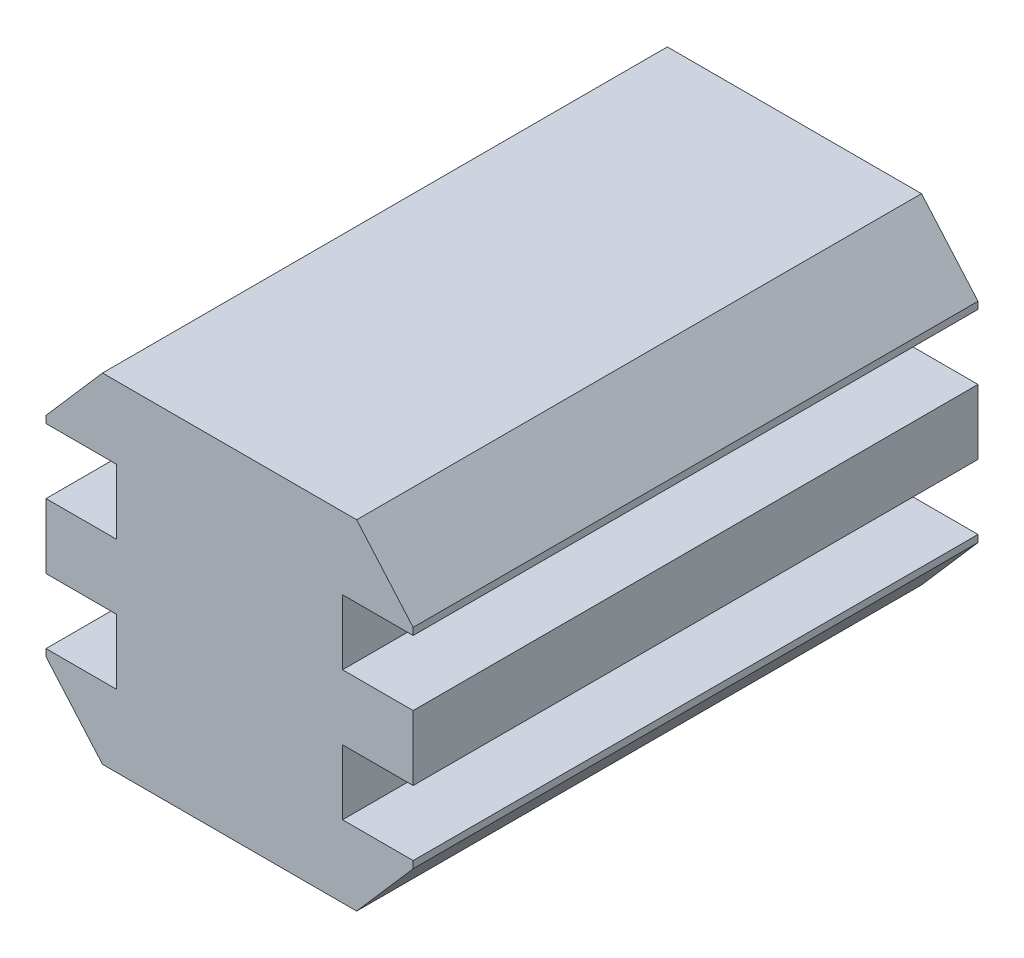
ISO-10303-21;
HEADER;
FILE_DESCRIPTION(('STEP AP214'),'2;1');
FILE_NAME('part.step','',(''),(''),'','','');
FILE_SCHEMA(('AUTOMOTIVE_DESIGN { 1 0 10303 214 1 1 1 1 }'));
ENDSEC;
DATA;
#1=APPLICATION_CONTEXT('core data for automotive mechanical design processes');
#2=APPLICATION_PROTOCOL_DEFINITION('international standard','automotive_design',2000,#1);
#3=PRODUCT_CONTEXT('',#1,'mechanical');
#4=PRODUCT('Part','Part','',(#3));
#5=PRODUCT_RELATED_PRODUCT_CATEGORY('part','',(#4));
#6=PRODUCT_DEFINITION_FORMATION('','',#4);
#7=PRODUCT_DEFINITION_CONTEXT('part definition',#1,'design');
#8=PRODUCT_DEFINITION('design','',#6,#7);
#9=PRODUCT_DEFINITION_SHAPE('','',#8);
#10=(LENGTH_UNIT() NAMED_UNIT(*) SI_UNIT(.MILLI.,.METRE.));
#11=(NAMED_UNIT(*) PLANE_ANGLE_UNIT() SI_UNIT($,.RADIAN.));
#12=(NAMED_UNIT(*) SI_UNIT($,.STERADIAN.) SOLID_ANGLE_UNIT());
#13=UNCERTAINTY_MEASURE_WITH_UNIT(LENGTH_MEASURE(1.E-05),#10,'distance_accuracy_value','');
#14=(GEOMETRIC_REPRESENTATION_CONTEXT(3) GLOBAL_UNCERTAINTY_ASSIGNED_CONTEXT((#13)) GLOBAL_UNIT_ASSIGNED_CONTEXT((#10,
#11,#12)) REPRESENTATION_CONTEXT('',''));
#15=CARTESIAN_POINT('',(0.,0.,0.));
#16=DIRECTION('',(0.,0.,1.));
#17=DIRECTION('',(1.,0.,0.));
#18=AXIS2_PLACEMENT_3D('',#15,#16,#17);
#19=CARTESIAN_POINT('',(4.,3.45,20.));
#20=DIRECTION('',(-1.,0.,0.));
#21=DIRECTION('',(0.,-1.,0.));
#22=AXIS2_PLACEMENT_3D('',#19,#20,#21);
#23=PLANE('',#22);
#24=DIRECTION('',(0.,1.,0.));
#25=VECTOR('',#24,1.);
#26=CARTESIAN_POINT('',(4.,3.45,0.));
#27=LINE('',#26,#25);
#28=CARTESIAN_POINT('',(4.,1.15,0.));
#29=VERTEX_POINT('',#28);
#30=CARTESIAN_POINT('',(4.,3.45,0.));
#31=VERTEX_POINT('',#30);
#32=EDGE_CURVE('E225',#29,#31,#27,.T.);
#33=ORIENTED_EDGE('',*,*,#32,.T.);
#34=DIRECTION('',(0.,0.,-1.));
#35=VECTOR('',#34,1.);
#36=CARTESIAN_POINT('',(4.,3.45,20.));
#37=LINE('',#36,#35);
#38=CARTESIAN_POINT('',(4.,3.45,20.));
#39=VERTEX_POINT('',#38);
#40=EDGE_CURVE('E11',#39,#31,#37,.T.);
#41=ORIENTED_EDGE('',*,*,#40,.F.);
#42=DIRECTION('',(0.,1.,0.));
#43=VECTOR('',#42,1.);
#44=CARTESIAN_POINT('',(4.,3.45,20.));
#45=LINE('',#44,#43);
#46=CARTESIAN_POINT('',(4.,1.15,20.));
#47=VERTEX_POINT('',#46);
#48=EDGE_CURVE('E271',#47,#39,#45,.T.);
#49=ORIENTED_EDGE('',*,*,#48,.F.);
#50=DIRECTION('',(0.,0.,-1.));
#51=VECTOR('',#50,1.);
#52=CARTESIAN_POINT('',(4.,1.15,20.));
#53=LINE('',#52,#51);
#54=EDGE_CURVE('E221',#47,#29,#53,.T.);
#55=ORIENTED_EDGE('',*,*,#54,.T.);
#56=EDGE_LOOP('',(#33,#41,#49,#55));
#57=FACE_BOUND('',#56,.T.);
#58=ADVANCED_FACE('F33',(#57),#23,.F.);
#59=CARTESIAN_POINT('',(6.5,3.45,20.));
#60=DIRECTION('',(0.,1.,0.));
#61=DIRECTION('',(-1.,0.,0.));
#62=AXIS2_PLACEMENT_3D('',#59,#60,#61);
#63=PLANE('',#62);
#64=DIRECTION('',(1.,0.,0.));
#65=VECTOR('',#64,1.);
#66=CARTESIAN_POINT('',(6.5,3.45,0.));
#67=LINE('',#66,#65);
#68=CARTESIAN_POINT('',(6.5,3.45,0.));
#69=VERTEX_POINT('',#68);
#70=EDGE_CURVE('E228',#31,#69,#67,.T.);
#71=ORIENTED_EDGE('',*,*,#70,.T.);
#72=DIRECTION('',(0.,0.,-1.));
#73=VECTOR('',#72,1.);
#74=CARTESIAN_POINT('',(6.5,3.45,20.));
#75=LINE('',#74,#73);
#76=CARTESIAN_POINT('',(6.5,3.45,20.));
#77=VERTEX_POINT('',#76);
#78=EDGE_CURVE('E41',#77,#69,#75,.T.);
#79=ORIENTED_EDGE('',*,*,#78,.F.);
#80=DIRECTION('',(1.,0.,0.));
#81=VECTOR('',#80,1.);
#82=CARTESIAN_POINT('',(6.5,3.45,20.));
#83=LINE('',#82,#81);
#84=EDGE_CURVE('E140',#39,#77,#83,.T.);
#85=ORIENTED_EDGE('',*,*,#84,.F.);
#86=ORIENTED_EDGE('',*,*,#40,.T.);
#87=EDGE_LOOP('',(#71,#79,#85,#86));
#88=FACE_BOUND('',#87,.T.);
#89=ADVANCED_FACE('F409',(#88),#63,.F.);
#90=CARTESIAN_POINT('',(6.5,3.7,20.));
#91=DIRECTION('',(-1.,0.,0.));
#92=DIRECTION('',(0.,-1.,0.));
#93=AXIS2_PLACEMENT_3D('',#90,#91,#92);
#94=PLANE('',#93);
#95=DIRECTION('',(0.,1.,0.));
#96=VECTOR('',#95,1.);
#97=CARTESIAN_POINT('',(6.5,3.7,0.));
#98=LINE('',#97,#96);
#99=CARTESIAN_POINT('',(6.5,3.7,0.));
#100=VERTEX_POINT('',#99);
#101=EDGE_CURVE('E230',#69,#100,#98,.T.);
#102=ORIENTED_EDGE('',*,*,#101,.T.);
#103=DIRECTION('',(0.,0.,-1.));
#104=VECTOR('',#103,1.);
#105=CARTESIAN_POINT('',(6.5,3.7,20.));
#106=LINE('',#105,#104);
#107=CARTESIAN_POINT('',(6.5,3.7,20.));
#108=VERTEX_POINT('',#107);
#109=EDGE_CURVE('E326',#108,#100,#106,.T.);
#110=ORIENTED_EDGE('',*,*,#109,.F.);
#111=DIRECTION('',(0.,1.,0.));
#112=VECTOR('',#111,1.);
#113=CARTESIAN_POINT('',(6.5,3.7,20.));
#114=LINE('',#113,#112);
#115=EDGE_CURVE('E334',#77,#108,#114,.T.);
#116=ORIENTED_EDGE('',*,*,#115,.F.);
#117=ORIENTED_EDGE('',*,*,#78,.T.);
#118=EDGE_LOOP('',(#102,#110,#116,#117));
#119=FACE_BOUND('',#118,.T.);
#120=ADVANCED_FACE('F332',(#119),#94,.F.);
#121=CARTESIAN_POINT('',(4.5,6.,20.));
#122=DIRECTION('',(-0.754605522163505,-0.656178714924786,0.));
#123=DIRECTION('',(0.656178714924786,-0.754605522163505,0.));
#124=AXIS2_PLACEMENT_3D('',#121,#122,#123);
#125=PLANE('',#124);
#126=DIRECTION('',(-0.656178714924786,0.754605522163505,0.));
#127=VECTOR('',#126,1.);
#128=CARTESIAN_POINT('',(4.5,6.,0.));
#129=LINE('',#128,#127);
#130=CARTESIAN_POINT('',(4.5,6.,0.));
#131=VERTEX_POINT('',#130);
#132=EDGE_CURVE('E232',#100,#131,#129,.T.);
#133=ORIENTED_EDGE('',*,*,#132,.T.);
#134=DIRECTION('',(0.,0.,-1.));
#135=VECTOR('',#134,1.);
#136=CARTESIAN_POINT('',(4.5,6.,20.));
#137=LINE('',#136,#135);
#138=CARTESIAN_POINT('',(4.5,6.,20.));
#139=VERTEX_POINT('',#138);
#140=EDGE_CURVE('E323',#139,#131,#137,.T.);
#141=ORIENTED_EDGE('',*,*,#140,.F.);
#142=DIRECTION('',(-0.656178714924786,0.754605522163505,0.));
#143=VECTOR('',#142,1.);
#144=CARTESIAN_POINT('',(4.5,6.,20.));
#145=LINE('',#144,#143);
#146=EDGE_CURVE('E352',#108,#139,#145,.T.);
#147=ORIENTED_EDGE('',*,*,#146,.F.);
#148=ORIENTED_EDGE('',*,*,#109,.T.);
#149=EDGE_LOOP('',(#133,#141,#147,#148));
#150=FACE_BOUND('',#149,.T.);
#151=ADVANCED_FACE('F343',(#150),#125,.F.);
#152=CARTESIAN_POINT('',(-4.5,6.,20.));
#153=DIRECTION('',(0.,-1.,0.));
#154=DIRECTION('',(1.,0.,0.));
#155=AXIS2_PLACEMENT_3D('',#152,#153,#154);
#156=PLANE('',#155);
#157=DIRECTION('',(-1.,0.,0.));
#158=VECTOR('',#157,1.);
#159=CARTESIAN_POINT('',(-4.5,6.,0.));
#160=LINE('',#159,#158);
#161=CARTESIAN_POINT('',(-4.5,6.,0.));
#162=VERTEX_POINT('',#161);
#163=EDGE_CURVE('E234',#131,#162,#160,.T.);
#164=ORIENTED_EDGE('',*,*,#163,.T.);
#165=DIRECTION('',(0.,0.,-1.));
#166=VECTOR('',#165,1.);
#167=CARTESIAN_POINT('',(-4.5,6.,20.));
#168=LINE('',#167,#166);
#169=CARTESIAN_POINT('',(-4.5,6.,20.));
#170=VERTEX_POINT('',#169);
#171=EDGE_CURVE('E320',#170,#162,#168,.T.);
#172=ORIENTED_EDGE('',*,*,#171,.F.);
#173=DIRECTION('',(-1.,0.,0.));
#174=VECTOR('',#173,1.);
#175=CARTESIAN_POINT('',(-4.5,6.,20.));
#176=LINE('',#175,#174);
#177=EDGE_CURVE('E349',#139,#170,#176,.T.);
#178=ORIENTED_EDGE('',*,*,#177,.F.);
#179=ORIENTED_EDGE('',*,*,#140,.T.);
#180=EDGE_LOOP('',(#164,#172,#178,#179));
#181=FACE_BOUND('',#180,.T.);
#182=ADVANCED_FACE('F347',(#181),#156,.F.);
#183=CARTESIAN_POINT('',(-4.5,6.,20.));
#184=DIRECTION('',(0.754605522163505,-0.656178714924786,0.));
#185=DIRECTION('',(0.656178714924786,0.754605522163505,0.));
#186=AXIS2_PLACEMENT_3D('',#183,#184,#185);
#187=PLANE('',#186);
#188=DIRECTION('',(-0.656178714924786,-0.754605522163505,0.));
#189=VECTOR('',#188,1.);
#190=CARTESIAN_POINT('',(-4.5,6.,0.));
#191=LINE('',#190,#189);
#192=CARTESIAN_POINT('',(-6.49999999999999,3.7,0.));
#193=VERTEX_POINT('',#192);
#194=EDGE_CURVE('E236',#162,#193,#191,.T.);
#195=ORIENTED_EDGE('',*,*,#194,.T.);
#196=DIRECTION('',(0.,0.,-1.));
#197=VECTOR('',#196,1.);
#198=CARTESIAN_POINT('',(-6.49999999999999,3.7,20.));
#199=LINE('',#198,#197);
#200=CARTESIAN_POINT('',(-6.49999999999999,3.7,20.));
#201=VERTEX_POINT('',#200);
#202=EDGE_CURVE('E317',#201,#193,#199,.T.);
#203=ORIENTED_EDGE('',*,*,#202,.F.);
#204=DIRECTION('',(-0.656178714924786,-0.754605522163505,0.));
#205=VECTOR('',#204,1.);
#206=CARTESIAN_POINT('',(-4.5,6.,20.));
#207=LINE('',#206,#205);
#208=EDGE_CURVE('E351',#170,#201,#207,.T.);
#209=ORIENTED_EDGE('',*,*,#208,.F.);
#210=ORIENTED_EDGE('',*,*,#171,.T.);
#211=EDGE_LOOP('',(#195,#203,#209,#210));
#212=FACE_BOUND('',#211,.T.);
#213=ADVANCED_FACE('F422',(#212),#187,.F.);
#214=CARTESIAN_POINT('',(-6.49999999999999,3.7,20.));
#215=DIRECTION('',(1.,0.,0.));
#216=DIRECTION('',(0.,1.,0.));
#217=AXIS2_PLACEMENT_3D('',#214,#215,#216);
#218=PLANE('',#217);
#219=DIRECTION('',(0.,-1.,0.));
#220=VECTOR('',#219,1.);
#221=CARTESIAN_POINT('',(-6.49999999999999,3.7,0.));
#222=LINE('',#221,#220);
#223=CARTESIAN_POINT('',(-6.5,3.45,0.));
#224=VERTEX_POINT('',#223);
#225=EDGE_CURVE('E238',#193,#224,#222,.T.);
#226=ORIENTED_EDGE('',*,*,#225,.T.);
#227=DIRECTION('',(0.,0.,-1.));
#228=VECTOR('',#227,1.);
#229=CARTESIAN_POINT('',(-6.5,3.45,20.));
#230=LINE('',#229,#228);
#231=CARTESIAN_POINT('',(-6.5,3.45,20.));
#232=VERTEX_POINT('',#231);
#233=EDGE_CURVE('E314',#232,#224,#230,.T.);
#234=ORIENTED_EDGE('',*,*,#233,.F.);
#235=DIRECTION('',(0.,-1.,0.));
#236=VECTOR('',#235,1.);
#237=CARTESIAN_POINT('',(-6.49999999999999,3.7,20.));
#238=LINE('',#237,#236);
#239=EDGE_CURVE('E354',#201,#232,#238,.T.);
#240=ORIENTED_EDGE('',*,*,#239,.F.);
#241=ORIENTED_EDGE('',*,*,#202,.T.);
#242=EDGE_LOOP('',(#226,#234,#240,#241));
#243=FACE_BOUND('',#242,.T.);
#244=ADVANCED_FACE('F425',(#243),#218,.F.);
#245=CARTESIAN_POINT('',(-6.5,3.45,20.));
#246=DIRECTION('',(0.,1.,0.));
#247=DIRECTION('',(-1.,0.,0.));
#248=AXIS2_PLACEMENT_3D('',#245,#246,#247);
#249=PLANE('',#248);
#250=DIRECTION('',(1.,0.,0.));
#251=VECTOR('',#250,1.);
#252=CARTESIAN_POINT('',(-6.5,3.45,0.));
#253=LINE('',#252,#251);
#254=CARTESIAN_POINT('',(-4.,3.45,0.));
#255=VERTEX_POINT('',#254);
#256=EDGE_CURVE('E240',#224,#255,#253,.T.);
#257=ORIENTED_EDGE('',*,*,#256,.T.);
#258=DIRECTION('',(0.,0.,-1.));
#259=VECTOR('',#258,1.);
#260=CARTESIAN_POINT('',(-4.,3.45,20.));
#261=LINE('',#260,#259);
#262=CARTESIAN_POINT('',(-4.,3.45,20.));
#263=VERTEX_POINT('',#262);
#264=EDGE_CURVE('E311',#263,#255,#261,.T.);
#265=ORIENTED_EDGE('',*,*,#264,.F.);
#266=DIRECTION('',(1.,0.,0.));
#267=VECTOR('',#266,1.);
#268=CARTESIAN_POINT('',(-6.5,3.45,20.));
#269=LINE('',#268,#267);
#270=EDGE_CURVE('E360',#232,#263,#269,.T.);
#271=ORIENTED_EDGE('',*,*,#270,.F.);
#272=ORIENTED_EDGE('',*,*,#233,.T.);
#273=EDGE_LOOP('',(#257,#265,#271,#272));
#274=FACE_BOUND('',#273,.T.);
#275=ADVANCED_FACE('F429',(#274),#249,.F.);
#276=CARTESIAN_POINT('',(-4.,3.45,20.));
#277=DIRECTION('',(1.,0.,0.));
#278=DIRECTION('',(0.,1.,0.));
#279=AXIS2_PLACEMENT_3D('',#276,#277,#278);
#280=PLANE('',#279);
#281=DIRECTION('',(0.,-1.,0.));
#282=VECTOR('',#281,1.);
#283=CARTESIAN_POINT('',(-4.,3.45,0.));
#284=LINE('',#283,#282);
#285=CARTESIAN_POINT('',(-4.,1.15,0.));
#286=VERTEX_POINT('',#285);
#287=EDGE_CURVE('E242',#255,#286,#284,.T.);
#288=ORIENTED_EDGE('',*,*,#287,.T.);
#289=DIRECTION('',(0.,0.,-1.));
#290=VECTOR('',#289,1.);
#291=CARTESIAN_POINT('',(-4.,1.15,20.));
#292=LINE('',#291,#290);
#293=CARTESIAN_POINT('',(-4.,1.15,20.));
#294=VERTEX_POINT('',#293);
#295=EDGE_CURVE('E308',#294,#286,#292,.T.);
#296=ORIENTED_EDGE('',*,*,#295,.F.);
#297=DIRECTION('',(0.,-1.,0.));
#298=VECTOR('',#297,1.);
#299=CARTESIAN_POINT('',(-4.,3.45,20.));
#300=LINE('',#299,#298);
#301=EDGE_CURVE('E362',#263,#294,#300,.T.);
#302=ORIENTED_EDGE('',*,*,#301,.F.);
#303=ORIENTED_EDGE('',*,*,#264,.T.);
#304=EDGE_LOOP('',(#288,#296,#302,#303));
#305=FACE_BOUND('',#304,.T.);
#306=ADVANCED_FACE('F433',(#305),#280,.F.);
#307=CARTESIAN_POINT('',(-4.,1.15,20.));
#308=DIRECTION('',(0.,-1.,0.));
#309=DIRECTION('',(1.,0.,0.));
#310=AXIS2_PLACEMENT_3D('',#307,#308,#309);
#311=PLANE('',#310);
#312=DIRECTION('',(-1.,0.,0.));
#313=VECTOR('',#312,1.);
#314=CARTESIAN_POINT('',(-4.,1.15,0.));
#315=LINE('',#314,#313);
#316=CARTESIAN_POINT('',(-6.5,1.15,0.));
#317=VERTEX_POINT('',#316);
#318=EDGE_CURVE('E244',#286,#317,#315,.T.);
#319=ORIENTED_EDGE('',*,*,#318,.T.);
#320=DIRECTION('',(0.,0.,-1.));
#321=VECTOR('',#320,1.);
#322=CARTESIAN_POINT('',(-6.5,1.15,20.));
#323=LINE('',#322,#321);
#324=CARTESIAN_POINT('',(-6.5,1.15,20.));
#325=VERTEX_POINT('',#324);
#326=EDGE_CURVE('E305',#325,#317,#323,.T.);
#327=ORIENTED_EDGE('',*,*,#326,.F.);
#328=DIRECTION('',(-1.,0.,0.));
#329=VECTOR('',#328,1.);
#330=CARTESIAN_POINT('',(-4.,1.15,20.));
#331=LINE('',#330,#329);
#332=EDGE_CURVE('E364',#294,#325,#331,.T.);
#333=ORIENTED_EDGE('',*,*,#332,.F.);
#334=ORIENTED_EDGE('',*,*,#295,.T.);
#335=EDGE_LOOP('',(#319,#327,#333,#334));
#336=FACE_BOUND('',#335,.T.);
#337=ADVANCED_FACE('F437',(#336),#311,.F.);
#338=CARTESIAN_POINT('',(-6.5,-1.15,20.));
#339=DIRECTION('',(1.,0.,0.));
#340=DIRECTION('',(0.,0.,-1.));
#341=AXIS2_PLACEMENT_3D('',#338,#339,#340);
#342=PLANE('',#341);
#343=DIRECTION('',(0.,-1.,0.));
#344=VECTOR('',#343,1.);
#345=CARTESIAN_POINT('',(-6.5,-1.15,0.));
#346=LINE('',#345,#344);
#347=CARTESIAN_POINT('',(-6.5,-1.15,0.));
#348=VERTEX_POINT('',#347);
#349=EDGE_CURVE('E246',#317,#348,#346,.T.);
#350=ORIENTED_EDGE('',*,*,#349,.T.);
#351=DIRECTION('',(0.,0.,-1.));
#352=VECTOR('',#351,1.);
#353=CARTESIAN_POINT('',(-6.5,-1.15,20.));
#354=LINE('',#353,#352);
#355=CARTESIAN_POINT('',(-6.5,-1.15,20.));
#356=VERTEX_POINT('',#355);
#357=EDGE_CURVE('E302',#356,#348,#354,.T.);
#358=ORIENTED_EDGE('',*,*,#357,.F.);
#359=DIRECTION('',(0.,-1.,0.));
#360=VECTOR('',#359,1.);
#361=CARTESIAN_POINT('',(-6.5,-1.15,20.));
#362=LINE('',#361,#360);
#363=EDGE_CURVE('E366',#325,#356,#362,.T.);
#364=ORIENTED_EDGE('',*,*,#363,.F.);
#365=ORIENTED_EDGE('',*,*,#326,.T.);
#366=EDGE_LOOP('',(#350,#358,#364,#365));
#367=FACE_BOUND('',#366,.T.);
#368=ADVANCED_FACE('F441',(#367),#342,.F.);
#369=CARTESIAN_POINT('',(-4.,-1.15,20.));
#370=DIRECTION('',(0.,1.,0.));
#371=DIRECTION('',(-1.,0.,0.));
#372=AXIS2_PLACEMENT_3D('',#369,#370,#371);
#373=PLANE('',#372);
#374=DIRECTION('',(1.,0.,0.));
#375=VECTOR('',#374,1.);
#376=CARTESIAN_POINT('',(-4.,-1.15,0.));
#377=LINE('',#376,#375);
#378=CARTESIAN_POINT('',(-4.,-1.15,0.));
#379=VERTEX_POINT('',#378);
#380=EDGE_CURVE('E248',#348,#379,#377,.T.);
#381=ORIENTED_EDGE('',*,*,#380,.T.);
#382=DIRECTION('',(0.,0.,-1.));
#383=VECTOR('',#382,1.);
#384=CARTESIAN_POINT('',(-4.,-1.15,20.));
#385=LINE('',#384,#383);
#386=CARTESIAN_POINT('',(-4.,-1.15,20.));
#387=VERTEX_POINT('',#386);
#388=EDGE_CURVE('E299',#387,#379,#385,.T.);
#389=ORIENTED_EDGE('',*,*,#388,.F.);
#390=DIRECTION('',(1.,0.,0.));
#391=VECTOR('',#390,1.);
#392=CARTESIAN_POINT('',(-4.,-1.15,20.));
#393=LINE('',#392,#391);
#394=EDGE_CURVE('E368',#356,#387,#393,.T.);
#395=ORIENTED_EDGE('',*,*,#394,.F.);
#396=ORIENTED_EDGE('',*,*,#357,.T.);
#397=EDGE_LOOP('',(#381,#389,#395,#396));
#398=FACE_BOUND('',#397,.T.);
#399=ADVANCED_FACE('F445',(#398),#373,.F.);
#400=CARTESIAN_POINT('',(-4.,-3.45,20.));
#401=DIRECTION('',(1.,0.,0.));
#402=DIRECTION('',(0.,1.,0.));
#403=AXIS2_PLACEMENT_3D('',#400,#401,#402);
#404=PLANE('',#403);
#405=DIRECTION('',(0.,-1.,0.));
#406=VECTOR('',#405,1.);
#407=CARTESIAN_POINT('',(-4.,-3.45,0.));
#408=LINE('',#407,#406);
#409=CARTESIAN_POINT('',(-4.,-3.45,0.));
#410=VERTEX_POINT('',#409);
#411=EDGE_CURVE('E250',#379,#410,#408,.T.);
#412=ORIENTED_EDGE('',*,*,#411,.T.);
#413=DIRECTION('',(0.,0.,-1.));
#414=VECTOR('',#413,1.);
#415=CARTESIAN_POINT('',(-4.,-3.45,20.));
#416=LINE('',#415,#414);
#417=CARTESIAN_POINT('',(-4.,-3.45,20.));
#418=VERTEX_POINT('',#417);
#419=EDGE_CURVE('E296',#418,#410,#416,.T.);
#420=ORIENTED_EDGE('',*,*,#419,.F.);
#421=DIRECTION('',(0.,-1.,0.));
#422=VECTOR('',#421,1.);
#423=CARTESIAN_POINT('',(-4.,-3.45,20.));
#424=LINE('',#423,#422);
#425=EDGE_CURVE('E370',#387,#418,#424,.T.);
#426=ORIENTED_EDGE('',*,*,#425,.F.);
#427=ORIENTED_EDGE('',*,*,#388,.T.);
#428=EDGE_LOOP('',(#412,#420,#426,#427));
#429=FACE_BOUND('',#428,.T.);
#430=ADVANCED_FACE('F449',(#429),#404,.F.);
#431=CARTESIAN_POINT('',(-6.49999999999999,-3.45,20.));
#432=DIRECTION('',(0.,-1.,0.));
#433=DIRECTION('',(1.,0.,0.));
#434=AXIS2_PLACEMENT_3D('',#431,#432,#433);
#435=PLANE('',#434);
#436=DIRECTION('',(-1.,0.,0.));
#437=VECTOR('',#436,1.);
#438=CARTESIAN_POINT('',(-6.49999999999999,-3.45,0.));
#439=LINE('',#438,#437);
#440=CARTESIAN_POINT('',(-6.49999999999999,-3.45,0.));
#441=VERTEX_POINT('',#440);
#442=EDGE_CURVE('E252',#410,#441,#439,.T.);
#443=ORIENTED_EDGE('',*,*,#442,.T.);
#444=DIRECTION('',(0.,0.,-1.));
#445=VECTOR('',#444,1.);
#446=CARTESIAN_POINT('',(-6.49999999999999,-3.45,20.));
#447=LINE('',#446,#445);
#448=CARTESIAN_POINT('',(-6.49999999999999,-3.45,20.));
#449=VERTEX_POINT('',#448);
#450=EDGE_CURVE('E293',#449,#441,#447,.T.);
#451=ORIENTED_EDGE('',*,*,#450,.F.);
#452=DIRECTION('',(-1.,0.,0.));
#453=VECTOR('',#452,1.);
#454=CARTESIAN_POINT('',(-6.49999999999999,-3.45,20.));
#455=LINE('',#454,#453);
#456=EDGE_CURVE('E372',#418,#449,#455,.T.);
#457=ORIENTED_EDGE('',*,*,#456,.F.);
#458=ORIENTED_EDGE('',*,*,#419,.T.);
#459=EDGE_LOOP('',(#443,#451,#457,#458));
#460=FACE_BOUND('',#459,.T.);
#461=ADVANCED_FACE('F453',(#460),#435,.F.);
#462=CARTESIAN_POINT('',(-6.49999999999999,-3.7,20.));
#463=DIRECTION('',(1.,0.,0.));
#464=DIRECTION('',(0.,0.,-1.));
#465=AXIS2_PLACEMENT_3D('',#462,#463,#464);
#466=PLANE('',#465);
#467=DIRECTION('',(0.,-1.,0.));
#468=VECTOR('',#467,1.);
#469=CARTESIAN_POINT('',(-6.49999999999999,-3.7,0.));
#470=LINE('',#469,#468);
#471=CARTESIAN_POINT('',(-6.49999999999999,-3.7,0.));
#472=VERTEX_POINT('',#471);
#473=EDGE_CURVE('E254',#441,#472,#470,.T.);
#474=ORIENTED_EDGE('',*,*,#473,.T.);
#475=DIRECTION('',(0.,0.,-1.));
#476=VECTOR('',#475,1.);
#477=CARTESIAN_POINT('',(-6.49999999999999,-3.7,20.));
#478=LINE('',#477,#476);
#479=CARTESIAN_POINT('',(-6.49999999999999,-3.7,20.));
#480=VERTEX_POINT('',#479);
#481=EDGE_CURVE('E290',#480,#472,#478,.T.);
#482=ORIENTED_EDGE('',*,*,#481,.F.);
#483=DIRECTION('',(0.,-1.,0.));
#484=VECTOR('',#483,1.);
#485=CARTESIAN_POINT('',(-6.49999999999999,-3.7,20.));
#486=LINE('',#485,#484);
#487=EDGE_CURVE('E374',#449,#480,#486,.T.);
#488=ORIENTED_EDGE('',*,*,#487,.F.);
#489=ORIENTED_EDGE('',*,*,#450,.T.);
#490=EDGE_LOOP('',(#474,#482,#488,#489));
#491=FACE_BOUND('',#490,.T.);
#492=ADVANCED_FACE('F457',(#491),#466,.F.);
#493=CARTESIAN_POINT('',(-4.5,-6.,20.));
#494=DIRECTION('',(0.754605522163505,0.656178714924786,0.));
#495=DIRECTION('',(-0.656178714924786,0.754605522163505,0.));
#496=AXIS2_PLACEMENT_3D('',#493,#494,#495);
#497=PLANE('',#496);
#498=DIRECTION('',(0.656178714924786,-0.754605522163505,0.));
#499=VECTOR('',#498,1.);
#500=CARTESIAN_POINT('',(-4.5,-6.,0.));
#501=LINE('',#500,#499);
#502=CARTESIAN_POINT('',(-4.5,-6.,0.));
#503=VERTEX_POINT('',#502);
#504=EDGE_CURVE('E256',#472,#503,#501,.T.);
#505=ORIENTED_EDGE('',*,*,#504,.T.);
#506=DIRECTION('',(0.,0.,-1.));
#507=VECTOR('',#506,1.);
#508=CARTESIAN_POINT('',(-4.5,-6.,20.));
#509=LINE('',#508,#507);
#510=CARTESIAN_POINT('',(-4.5,-6.,20.));
#511=VERTEX_POINT('',#510);
#512=EDGE_CURVE('E287',#511,#503,#509,.T.);
#513=ORIENTED_EDGE('',*,*,#512,.F.);
#514=DIRECTION('',(0.656178714924786,-0.754605522163505,0.));
#515=VECTOR('',#514,1.);
#516=CARTESIAN_POINT('',(-4.5,-6.,20.));
#517=LINE('',#516,#515);
#518=EDGE_CURVE('E376',#480,#511,#517,.T.);
#519=ORIENTED_EDGE('',*,*,#518,.F.);
#520=ORIENTED_EDGE('',*,*,#481,.T.);
#521=EDGE_LOOP('',(#505,#513,#519,#520));
#522=FACE_BOUND('',#521,.T.);
#523=ADVANCED_FACE('F461',(#522),#497,.F.);
#524=CARTESIAN_POINT('',(-4.5,-6.,20.));
#525=DIRECTION('',(0.,1.,0.));
#526=DIRECTION('',(-1.,0.,0.));
#527=AXIS2_PLACEMENT_3D('',#524,#525,#526);
#528=PLANE('',#527);
#529=DIRECTION('',(1.,0.,0.));
#530=VECTOR('',#529,1.);
#531=CARTESIAN_POINT('',(-4.5,-6.,0.));
#532=LINE('',#531,#530);
#533=CARTESIAN_POINT('',(4.5,-6.,0.));
#534=VERTEX_POINT('',#533);
#535=EDGE_CURVE('E258',#503,#534,#532,.T.);
#536=ORIENTED_EDGE('',*,*,#535,.T.);
#537=DIRECTION('',(0.,0.,-1.));
#538=VECTOR('',#537,1.);
#539=CARTESIAN_POINT('',(4.5,-6.,20.));
#540=LINE('',#539,#538);
#541=CARTESIAN_POINT('',(4.5,-6.,20.));
#542=VERTEX_POINT('',#541);
#543=EDGE_CURVE('E284',#542,#534,#540,.T.);
#544=ORIENTED_EDGE('',*,*,#543,.F.);
#545=DIRECTION('',(1.,0.,0.));
#546=VECTOR('',#545,1.);
#547=CARTESIAN_POINT('',(-4.5,-6.,20.));
#548=LINE('',#547,#546);
#549=EDGE_CURVE('E378',#511,#542,#548,.T.);
#550=ORIENTED_EDGE('',*,*,#549,.F.);
#551=ORIENTED_EDGE('',*,*,#512,.T.);
#552=EDGE_LOOP('',(#536,#544,#550,#551));
#553=FACE_BOUND('',#552,.T.);
#554=ADVANCED_FACE('F465',(#553),#528,.F.);
#555=CARTESIAN_POINT('',(4.5,-6.,20.));
#556=DIRECTION('',(-0.754605522163505,0.656178714924786,0.));
#557=DIRECTION('',(-0.656178714924786,-0.754605522163505,0.));
#558=AXIS2_PLACEMENT_3D('',#555,#556,#557);
#559=PLANE('',#558);
#560=DIRECTION('',(0.656178714924786,0.754605522163505,0.));
#561=VECTOR('',#560,1.);
#562=CARTESIAN_POINT('',(4.5,-6.,0.));
#563=LINE('',#562,#561);
#564=CARTESIAN_POINT('',(6.5,-3.7,0.));
#565=VERTEX_POINT('',#564);
#566=EDGE_CURVE('E260',#534,#565,#563,.T.);
#567=ORIENTED_EDGE('',*,*,#566,.T.);
#568=DIRECTION('',(0.,0.,-1.));
#569=VECTOR('',#568,1.);
#570=CARTESIAN_POINT('',(6.5,-3.7,20.));
#571=LINE('',#570,#569);
#572=CARTESIAN_POINT('',(6.5,-3.7,20.));
#573=VERTEX_POINT('',#572);
#574=EDGE_CURVE('E281',#573,#565,#571,.T.);
#575=ORIENTED_EDGE('',*,*,#574,.F.);
#576=DIRECTION('',(0.656178714924786,0.754605522163505,0.));
#577=VECTOR('',#576,1.);
#578=CARTESIAN_POINT('',(4.5,-6.,20.));
#579=LINE('',#578,#577);
#580=EDGE_CURVE('E380',#542,#573,#579,.T.);
#581=ORIENTED_EDGE('',*,*,#580,.F.);
#582=ORIENTED_EDGE('',*,*,#543,.T.);
#583=EDGE_LOOP('',(#567,#575,#581,#582));
#584=FACE_BOUND('',#583,.T.);
#585=ADVANCED_FACE('F469',(#584),#559,.F.);
#586=CARTESIAN_POINT('',(6.5,-3.7,20.));
#587=DIRECTION('',(-1.,0.,0.));
#588=DIRECTION('',(0.,-1.,0.));
#589=AXIS2_PLACEMENT_3D('',#586,#587,#588);
#590=PLANE('',#589);
#591=DIRECTION('',(0.,1.,0.));
#592=VECTOR('',#591,1.);
#593=CARTESIAN_POINT('',(6.5,-3.7,0.));
#594=LINE('',#593,#592);
#595=CARTESIAN_POINT('',(6.5,-3.45,0.));
#596=VERTEX_POINT('',#595);
#597=EDGE_CURVE('E262',#565,#596,#594,.T.);
#598=ORIENTED_EDGE('',*,*,#597,.T.);
#599=DIRECTION('',(0.,0.,-1.));
#600=VECTOR('',#599,1.);
#601=CARTESIAN_POINT('',(6.5,-3.45,20.));
#602=LINE('',#601,#600);
#603=CARTESIAN_POINT('',(6.5,-3.45,20.));
#604=VERTEX_POINT('',#603);
#605=EDGE_CURVE('E278',#604,#596,#602,.T.);
#606=ORIENTED_EDGE('',*,*,#605,.F.);
#607=DIRECTION('',(0.,1.,0.));
#608=VECTOR('',#607,1.);
#609=CARTESIAN_POINT('',(6.5,-3.7,20.));
#610=LINE('',#609,#608);
#611=EDGE_CURVE('E382',#573,#604,#610,.T.);
#612=ORIENTED_EDGE('',*,*,#611,.F.);
#613=ORIENTED_EDGE('',*,*,#574,.T.);
#614=EDGE_LOOP('',(#598,#606,#612,#613));
#615=FACE_BOUND('',#614,.T.);
#616=ADVANCED_FACE('F473',(#615),#590,.F.);
#617=CARTESIAN_POINT('',(6.5,-3.45,20.));
#618=DIRECTION('',(0.,-1.,0.));
#619=DIRECTION('',(1.,0.,0.));
#620=AXIS2_PLACEMENT_3D('',#617,#618,#619);
#621=PLANE('',#620);
#622=DIRECTION('',(-1.,0.,0.));
#623=VECTOR('',#622,1.);
#624=CARTESIAN_POINT('',(6.5,-3.45,0.));
#625=LINE('',#624,#623);
#626=CARTESIAN_POINT('',(4.,-3.45,0.));
#627=VERTEX_POINT('',#626);
#628=EDGE_CURVE('E264',#596,#627,#625,.T.);
#629=ORIENTED_EDGE('',*,*,#628,.T.);
#630=DIRECTION('',(0.,0.,-1.));
#631=VECTOR('',#630,1.);
#632=CARTESIAN_POINT('',(4.,-3.45,20.));
#633=LINE('',#632,#631);
#634=CARTESIAN_POINT('',(4.,-3.45,20.));
#635=VERTEX_POINT('',#634);
#636=EDGE_CURVE('E275',#635,#627,#633,.T.);
#637=ORIENTED_EDGE('',*,*,#636,.F.);
#638=DIRECTION('',(-1.,0.,0.));
#639=VECTOR('',#638,1.);
#640=CARTESIAN_POINT('',(6.5,-3.45,20.));
#641=LINE('',#640,#639);
#642=EDGE_CURVE('E384',#604,#635,#641,.T.);
#643=ORIENTED_EDGE('',*,*,#642,.F.);
#644=ORIENTED_EDGE('',*,*,#605,.T.);
#645=EDGE_LOOP('',(#629,#637,#643,#644));
#646=FACE_BOUND('',#645,.T.);
#647=ADVANCED_FACE('F390',(#646),#621,.F.);
#648=CARTESIAN_POINT('',(4.,-3.45,20.));
#649=DIRECTION('',(-1.,0.,0.));
#650=DIRECTION('',(0.,-1.,0.));
#651=AXIS2_PLACEMENT_3D('',#648,#649,#650);
#652=PLANE('',#651);
#653=DIRECTION('',(0.,1.,0.));
#654=VECTOR('',#653,1.);
#655=CARTESIAN_POINT('',(4.,-3.45,0.));
#656=LINE('',#655,#654);
#657=CARTESIAN_POINT('',(4.,-1.15,0.));
#658=VERTEX_POINT('',#657);
#659=EDGE_CURVE('E266',#627,#658,#656,.T.);
#660=ORIENTED_EDGE('',*,*,#659,.T.);
#661=DIRECTION('',(0.,0.,-1.));
#662=VECTOR('',#661,1.);
#663=CARTESIAN_POINT('',(4.,-1.15,20.));
#664=LINE('',#663,#662);
#665=CARTESIAN_POINT('',(4.,-1.15,20.));
#666=VERTEX_POINT('',#665);
#667=EDGE_CURVE('E216',#666,#658,#664,.T.);
#668=ORIENTED_EDGE('',*,*,#667,.F.);
#669=DIRECTION('',(0.,1.,0.));
#670=VECTOR('',#669,1.);
#671=CARTESIAN_POINT('',(4.,-3.45,20.));
#672=LINE('',#671,#670);
#673=EDGE_CURVE('E207',#635,#666,#672,.T.);
#674=ORIENTED_EDGE('',*,*,#673,.F.);
#675=ORIENTED_EDGE('',*,*,#636,.T.);
#676=EDGE_LOOP('',(#660,#668,#674,#675));
#677=FACE_BOUND('',#676,.T.);
#678=ADVANCED_FACE('F394',(#677),#652,.F.);
#679=CARTESIAN_POINT('',(4.,-1.15,20.));
#680=DIRECTION('',(0.,1.,0.));
#681=DIRECTION('',(-1.,0.,0.));
#682=AXIS2_PLACEMENT_3D('',#679,#680,#681);
#683=PLANE('',#682);
#684=DIRECTION('',(1.,0.,0.));
#685=VECTOR('',#684,1.);
#686=CARTESIAN_POINT('',(4.,-1.15,0.));
#687=LINE('',#686,#685);
#688=CARTESIAN_POINT('',(6.5,-1.15,0.));
#689=VERTEX_POINT('',#688);
#690=EDGE_CURVE('E215',#658,#689,#687,.T.);
#691=ORIENTED_EDGE('',*,*,#690,.T.);
#692=DIRECTION('',(0.,0.,-1.));
#693=VECTOR('',#692,1.);
#694=CARTESIAN_POINT('',(6.5,-1.15,20.));
#695=LINE('',#694,#693);
#696=CARTESIAN_POINT('',(6.5,-1.15,20.));
#697=VERTEX_POINT('',#696);
#698=EDGE_CURVE('E212',#697,#689,#695,.T.);
#699=ORIENTED_EDGE('',*,*,#698,.F.);
#700=DIRECTION('',(1.,0.,0.));
#701=VECTOR('',#700,1.);
#702=CARTESIAN_POINT('',(4.,-1.15,20.));
#703=LINE('',#702,#701);
#704=EDGE_CURVE('E201',#666,#697,#703,.T.);
#705=ORIENTED_EDGE('',*,*,#704,.F.);
#706=ORIENTED_EDGE('',*,*,#667,.T.);
#707=EDGE_LOOP('',(#691,#699,#705,#706));
#708=FACE_BOUND('',#707,.T.);
#709=ADVANCED_FACE('F213',(#708),#683,.F.);
#710=CARTESIAN_POINT('',(6.5,-1.15,20.));
#711=DIRECTION('',(-1.,0.,0.));
#712=DIRECTION('',(0.,0.,1.));
#713=AXIS2_PLACEMENT_3D('',#710,#711,#712);
#714=PLANE('',#713);
#715=DIRECTION('',(0.,1.,0.));
#716=VECTOR('',#715,1.);
#717=CARTESIAN_POINT('',(6.5,-1.15,0.));
#718=LINE('',#717,#716);
#719=CARTESIAN_POINT('',(6.5,1.15,0.));
#720=VERTEX_POINT('',#719);
#721=EDGE_CURVE('E126',#689,#720,#718,.T.);
#722=ORIENTED_EDGE('',*,*,#721,.T.);
#723=DIRECTION('',(0.,0.,-1.));
#724=VECTOR('',#723,1.);
#725=CARTESIAN_POINT('',(6.5,1.15,20.));
#726=LINE('',#725,#724);
#727=CARTESIAN_POINT('',(6.5,1.15,20.));
#728=VERTEX_POINT('',#727);
#729=EDGE_CURVE('E217',#728,#720,#726,.T.);
#730=ORIENTED_EDGE('',*,*,#729,.F.);
#731=DIRECTION('',(0.,1.,0.));
#732=VECTOR('',#731,1.);
#733=CARTESIAN_POINT('',(6.5,-1.15,20.));
#734=LINE('',#733,#732);
#735=EDGE_CURVE('E205',#697,#728,#734,.T.);
#736=ORIENTED_EDGE('',*,*,#735,.F.);
#737=ORIENTED_EDGE('',*,*,#698,.T.);
#738=EDGE_LOOP('',(#722,#730,#736,#737));
#739=FACE_BOUND('',#738,.T.);
#740=ADVANCED_FACE('F219',(#739),#714,.F.);
#741=CARTESIAN_POINT('',(4.,1.15,20.));
#742=DIRECTION('',(0.,-1.,0.));
#743=DIRECTION('',(1.,0.,0.));
#744=AXIS2_PLACEMENT_3D('',#741,#742,#743);
#745=PLANE('',#744);
#746=DIRECTION('',(-1.,0.,0.));
#747=VECTOR('',#746,1.);
#748=CARTESIAN_POINT('',(4.,1.15,0.));
#749=LINE('',#748,#747);
#750=EDGE_CURVE('E132',#720,#29,#749,.T.);
#751=ORIENTED_EDGE('',*,*,#750,.T.);
#752=ORIENTED_EDGE('',*,*,#54,.F.);
#753=DIRECTION('',(-1.,0.,0.));
#754=VECTOR('',#753,1.);
#755=CARTESIAN_POINT('',(4.,1.15,20.));
#756=LINE('',#755,#754);
#757=EDGE_CURVE('E49',#728,#47,#756,.T.);
#758=ORIENTED_EDGE('',*,*,#757,.F.);
#759=ORIENTED_EDGE('',*,*,#729,.T.);
#760=EDGE_LOOP('',(#751,#752,#758,#759));
#761=FACE_BOUND('',#760,.T.);
#762=ADVANCED_FACE('F398',(#761),#745,.F.);
#763=CARTESIAN_POINT('',(0.,0.,20.));
#764=DIRECTION('',(0.,0.,1.));
#765=DIRECTION('',(1.,0.,0.));
#766=AXIS2_PLACEMENT_3D('',#763,#764,#765);
#767=PLANE('',#766);
#768=ORIENTED_EDGE('',*,*,#48,.T.);
#769=ORIENTED_EDGE('',*,*,#84,.T.);
#770=ORIENTED_EDGE('',*,*,#115,.T.);
#771=ORIENTED_EDGE('',*,*,#146,.T.);
#772=ORIENTED_EDGE('',*,*,#177,.T.);
#773=ORIENTED_EDGE('',*,*,#208,.T.);
#774=ORIENTED_EDGE('',*,*,#239,.T.);
#775=ORIENTED_EDGE('',*,*,#270,.T.);
#776=ORIENTED_EDGE('',*,*,#301,.T.);
#777=ORIENTED_EDGE('',*,*,#332,.T.);
#778=ORIENTED_EDGE('',*,*,#363,.T.);
#779=ORIENTED_EDGE('',*,*,#394,.T.);
#780=ORIENTED_EDGE('',*,*,#425,.T.);
#781=ORIENTED_EDGE('',*,*,#456,.T.);
#782=ORIENTED_EDGE('',*,*,#487,.T.);
#783=ORIENTED_EDGE('',*,*,#518,.T.);
#784=ORIENTED_EDGE('',*,*,#549,.T.);
#785=ORIENTED_EDGE('',*,*,#580,.T.);
#786=ORIENTED_EDGE('',*,*,#611,.T.);
#787=ORIENTED_EDGE('',*,*,#642,.T.);
#788=ORIENTED_EDGE('',*,*,#673,.T.);
#789=ORIENTED_EDGE('',*,*,#704,.T.);
#790=ORIENTED_EDGE('',*,*,#735,.T.);
#791=ORIENTED_EDGE('',*,*,#757,.T.);
#792=EDGE_LOOP('',(#768,#769,#770,#771,#772,#773,#774,#775,#776,#777,#778,#779,#780,#781,#782,
#783,#784,#785,#786,#787,#788,#789,#790,#791));
#793=FACE_BOUND('',#792,.T.);
#794=ADVANCED_FACE('F203',(#793),#767,.T.);
#795=CARTESIAN_POINT('',(0.,0.,0.));
#796=DIRECTION('',(0.,0.,1.));
#797=DIRECTION('',(1.,0.,0.));
#798=AXIS2_PLACEMENT_3D('',#795,#796,#797);
#799=PLANE('',#798);
#800=ORIENTED_EDGE('',*,*,#32,.F.);
#801=ORIENTED_EDGE('',*,*,#750,.F.);
#802=ORIENTED_EDGE('',*,*,#721,.F.);
#803=ORIENTED_EDGE('',*,*,#690,.F.);
#804=ORIENTED_EDGE('',*,*,#659,.F.);
#805=ORIENTED_EDGE('',*,*,#628,.F.);
#806=ORIENTED_EDGE('',*,*,#597,.F.);
#807=ORIENTED_EDGE('',*,*,#566,.F.);
#808=ORIENTED_EDGE('',*,*,#535,.F.);
#809=ORIENTED_EDGE('',*,*,#504,.F.);
#810=ORIENTED_EDGE('',*,*,#473,.F.);
#811=ORIENTED_EDGE('',*,*,#442,.F.);
#812=ORIENTED_EDGE('',*,*,#411,.F.);
#813=ORIENTED_EDGE('',*,*,#380,.F.);
#814=ORIENTED_EDGE('',*,*,#349,.F.);
#815=ORIENTED_EDGE('',*,*,#318,.F.);
#816=ORIENTED_EDGE('',*,*,#287,.F.);
#817=ORIENTED_EDGE('',*,*,#256,.F.);
#818=ORIENTED_EDGE('',*,*,#225,.F.);
#819=ORIENTED_EDGE('',*,*,#194,.F.);
#820=ORIENTED_EDGE('',*,*,#163,.F.);
#821=ORIENTED_EDGE('',*,*,#132,.F.);
#822=ORIENTED_EDGE('',*,*,#101,.F.);
#823=ORIENTED_EDGE('',*,*,#70,.F.);
#824=EDGE_LOOP('',(#800,#801,#802,#803,#804,#805,#806,#807,#808,#809,#810,#811,#812,#813,#814,
#815,#816,#817,#818,#819,#820,#821,#822,#823));
#825=FACE_BOUND('',#824,.T.);
#826=ADVANCED_FACE('F338',(#825),#799,.F.);
#827=CLOSED_SHELL('',(#58,#89,#120,#151,#182,#213,#244,#275,#306,#337,#368,#399,#430,#461,#492,
#523,#554,#585,#616,#647,#678,#709,#740,#762,#794,#826));
#828=MANIFOLD_SOLID_BREP('B2',#827);
#829=ADVANCED_BREP_SHAPE_REPRESENTATION('',(#18,#828),#14);
#830=SHAPE_DEFINITION_REPRESENTATION(#9,#829);
ENDSEC;
END-ISO-10303-21;
